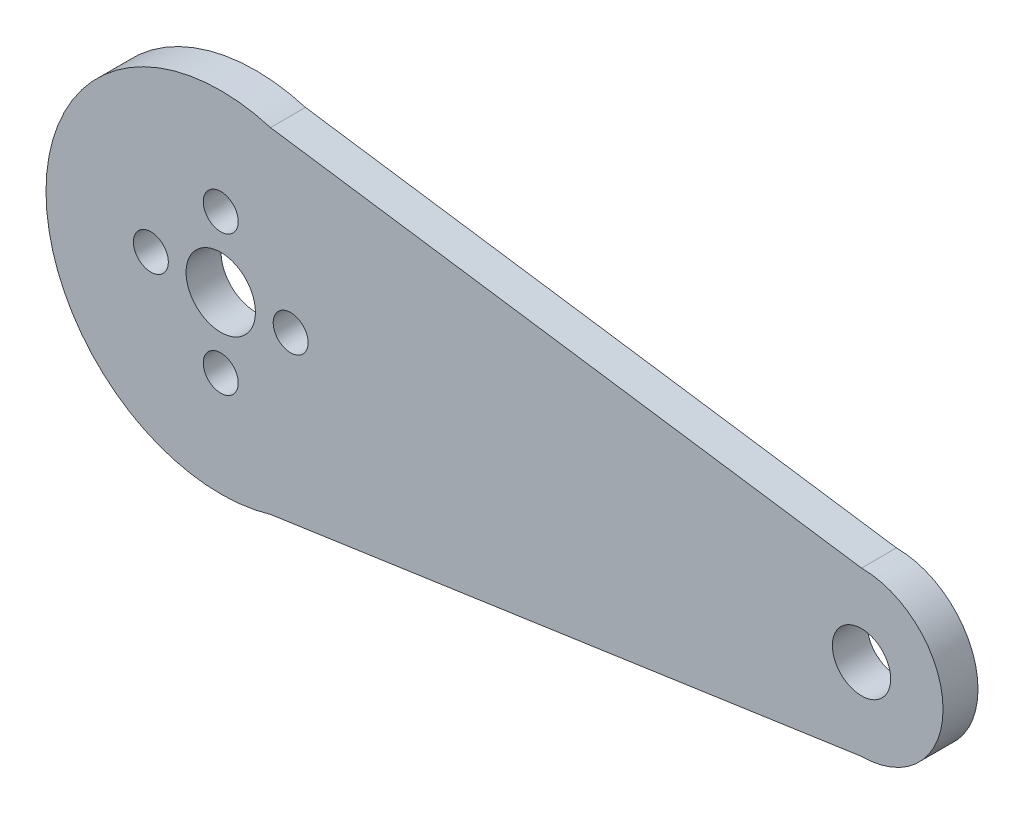
ISO-10303-21;
HEADER;
FILE_DESCRIPTION(('STEP AP214'),'2;1');
FILE_NAME('part.step','',(''),(''),'','','');
FILE_SCHEMA(('AUTOMOTIVE_DESIGN { 1 0 10303 214 1 1 1 1 }'));
ENDSEC;
DATA;
#1=APPLICATION_CONTEXT('core data for automotive mechanical design processes');
#2=APPLICATION_PROTOCOL_DEFINITION('international standard','automotive_design',2000,#1);
#3=PRODUCT_CONTEXT('',#1,'mechanical');
#4=PRODUCT('Part','Part','',(#3));
#5=PRODUCT_RELATED_PRODUCT_CATEGORY('part','',(#4));
#6=PRODUCT_DEFINITION_FORMATION('','',#4);
#7=PRODUCT_DEFINITION_CONTEXT('part definition',#1,'design');
#8=PRODUCT_DEFINITION('design','',#6,#7);
#9=PRODUCT_DEFINITION_SHAPE('','',#8);
#10=(LENGTH_UNIT() NAMED_UNIT(*) SI_UNIT(.MILLI.,.METRE.));
#11=(NAMED_UNIT(*) PLANE_ANGLE_UNIT() SI_UNIT($,.RADIAN.));
#12=(NAMED_UNIT(*) SI_UNIT($,.STERADIAN.) SOLID_ANGLE_UNIT());
#13=UNCERTAINTY_MEASURE_WITH_UNIT(LENGTH_MEASURE(1.E-05),#10,'distance_accuracy_value','');
#14=(GEOMETRIC_REPRESENTATION_CONTEXT(3) GLOBAL_UNCERTAINTY_ASSIGNED_CONTEXT((#13)) GLOBAL_UNIT_ASSIGNED_CONTEXT((#10,
#11,#12)) REPRESENTATION_CONTEXT('',''));
#15=CARTESIAN_POINT('',(0.,0.,0.));
#16=DIRECTION('',(0.,0.,1.));
#17=DIRECTION('',(1.,0.,0.));
#18=AXIS2_PLACEMENT_3D('',#15,#16,#17);
#19=CARTESIAN_POINT('',(-0.759875943961661,7.25048296530086,3.));
#20=DIRECTION('',(0.,0.,1.));
#21=DIRECTION('',(1.,0.,0.));
#22=AXIS2_PLACEMENT_3D('',#19,#20,#21);
#23=PLANE('',#22);
#24=DIRECTION('',(-0.989586439284512,0.143939845714111,0.));
#25=VECTOR('',#24,1.);
#26=CARTESIAN_POINT('',(-0.759875943961661,22.2504829653009,3.));
#27=LINE('',#26,#25);
#28=CARTESIAN_POINT('',(54.2401240560383,14.2504829653009,3.));
#29=VERTEX_POINT('',#28);
#30=CARTESIAN_POINT('',(3.51335163777999,21.6289225897748,3.));
#31=VERTEX_POINT('',#30);
#32=EDGE_CURVE('E92',#29,#31,#27,.T.);
#33=ORIENTED_EDGE('',*,*,#32,.T.);
#34=CARTESIAN_POINT('',(-0.759875943961661,7.25048296530086,3.));
#35=DIRECTION('',(0.,0.,1.));
#36=DIRECTION('',(1.,0.,0.));
#37=AXIS2_PLACEMENT_3D('',#34,#35,#36);
#38=CIRCLE('',#37,15.);
#39=CARTESIAN_POINT('',(3.51335163777999,-7.12795665917308,3.));
#40=VERTEX_POINT('',#39);
#41=EDGE_CURVE('E57',#31,#40,#38,.T.);
#42=ORIENTED_EDGE('',*,*,#41,.T.);
#43=DIRECTION('',(0.989586439284512,0.143939845714111,0.));
#44=VECTOR('',#43,1.);
#45=CARTESIAN_POINT('',(-0.759875943961661,-7.74951703469913,3.));
#46=LINE('',#45,#44);
#47=CARTESIAN_POINT('',(54.2401240560383,0.250482965300865,3.));
#48=VERTEX_POINT('',#47);
#49=EDGE_CURVE('E74',#40,#48,#46,.T.);
#50=ORIENTED_EDGE('',*,*,#49,.T.);
#51=CARTESIAN_POINT('',(54.2401240560383,7.25048296530086,3.));
#52=DIRECTION('',(0.,0.,1.));
#53=DIRECTION('',(1.,0.,0.));
#54=AXIS2_PLACEMENT_3D('',#51,#52,#53);
#55=CIRCLE('',#54,7.);
#56=EDGE_CURVE('E78',#48,#29,#55,.T.);
#57=ORIENTED_EDGE('',*,*,#56,.T.);
#58=EDGE_LOOP('',(#33,#42,#50,#57));
#59=FACE_BOUND('',#58,.T.);
#60=CARTESIAN_POINT('',(54.2401240560383,7.25048296530086,3.));
#61=DIRECTION('',(0.,0.,1.));
#62=DIRECTION('',(1.,0.,0.));
#63=AXIS2_PLACEMENT_3D('',#60,#61,#62);
#64=CIRCLE('',#63,2.5);
#65=CARTESIAN_POINT('',(56.7401240560383,7.25048296530086,3.));
#66=VERTEX_POINT('',#65);
#67=EDGE_CURVE('E81',#66,#66,#64,.T.);
#68=ORIENTED_EDGE('',*,*,#67,.F.);
#69=EDGE_LOOP('',(#68));
#70=FACE_BOUND('',#69,.T.);
#71=CARTESIAN_POINT('',(5.24012405603834,7.25048296530086,3.));
#72=DIRECTION('',(0.,0.,1.));
#73=DIRECTION('',(1.,0.,0.));
#74=AXIS2_PLACEMENT_3D('',#71,#72,#73);
#75=CIRCLE('',#74,1.5);
#76=CARTESIAN_POINT('',(6.74012405603834,7.25048296530086,3.));
#77=VERTEX_POINT('',#76);
#78=EDGE_CURVE('E106',#77,#77,#75,.T.);
#79=ORIENTED_EDGE('',*,*,#78,.F.);
#80=EDGE_LOOP('',(#79));
#81=FACE_BOUND('',#80,.T.);
#82=CARTESIAN_POINT('',(-6.75987594396166,7.25048296530086,3.));
#83=DIRECTION('',(0.,0.,1.));
#84=DIRECTION('',(1.,0.,0.));
#85=AXIS2_PLACEMENT_3D('',#82,#83,#84);
#86=CIRCLE('',#85,1.5);
#87=CARTESIAN_POINT('',(-5.25987594396166,7.25048296530086,3.));
#88=VERTEX_POINT('',#87);
#89=EDGE_CURVE('E118',#88,#88,#86,.T.);
#90=ORIENTED_EDGE('',*,*,#89,.F.);
#91=EDGE_LOOP('',(#90));
#92=FACE_BOUND('',#91,.T.);
#93=CARTESIAN_POINT('',(-0.759875943961661,7.25048296530086,3.));
#94=DIRECTION('',(0.,0.,1.));
#95=DIRECTION('',(1.,0.,0.));
#96=AXIS2_PLACEMENT_3D('',#93,#94,#95);
#97=CIRCLE('',#96,2.97685435318113);
#98=CARTESIAN_POINT('',(2.21697840921947,7.25048296530086,3.));
#99=VERTEX_POINT('',#98);
#100=EDGE_CURVE('E130',#99,#99,#97,.T.);
#101=ORIENTED_EDGE('',*,*,#100,.F.);
#102=EDGE_LOOP('',(#101));
#103=FACE_BOUND('',#102,.T.);
#104=CARTESIAN_POINT('',(-0.759875943961661,13.2504829653009,3.));
#105=DIRECTION('',(0.,0.,1.));
#106=DIRECTION('',(1.,0.,0.));
#107=AXIS2_PLACEMENT_3D('',#104,#105,#106);
#108=CIRCLE('',#107,1.5);
#109=CARTESIAN_POINT('',(0.740124056038339,13.2504829653009,3.));
#110=VERTEX_POINT('',#109);
#111=EDGE_CURVE('E124',#110,#110,#108,.T.);
#112=ORIENTED_EDGE('',*,*,#111,.F.);
#113=EDGE_LOOP('',(#112));
#114=FACE_BOUND('',#113,.T.);
#115=CARTESIAN_POINT('',(-0.759875943961661,1.25048296530086,3.));
#116=DIRECTION('',(0.,0.,1.));
#117=DIRECTION('',(1.,0.,0.));
#118=AXIS2_PLACEMENT_3D('',#115,#116,#117);
#119=CIRCLE('',#118,1.5);
#120=CARTESIAN_POINT('',(0.74012405603834,1.25048296530086,3.));
#121=VERTEX_POINT('',#120);
#122=EDGE_CURVE('E112',#121,#121,#119,.T.);
#123=ORIENTED_EDGE('',*,*,#122,.F.);
#124=EDGE_LOOP('',(#123));
#125=FACE_BOUND('',#124,.T.);
#126=ADVANCED_FACE('F35',(#59,#70,#81,#92,#103,#114,#125),#23,.T.);
#127=CARTESIAN_POINT('',(-0.759875943961661,7.25048296530086,0.));
#128=DIRECTION('',(0.,0.,1.));
#129=DIRECTION('',(1.,0.,0.));
#130=AXIS2_PLACEMENT_3D('',#127,#128,#129);
#131=PLANE('',#130);
#132=DIRECTION('',(-0.989586439284512,-0.143939845714111,0.));
#133=VECTOR('',#132,1.);
#134=CARTESIAN_POINT('',(-0.759875943961661,-7.74951703469913,0.));
#135=LINE('',#134,#133);
#136=CARTESIAN_POINT('',(54.2401240560383,0.250482965300865,0.));
#137=VERTEX_POINT('',#136);
#138=CARTESIAN_POINT('',(3.51335163777999,-7.12795665917308,0.));
#139=VERTEX_POINT('',#138);
#140=EDGE_CURVE('E88',#137,#139,#135,.T.);
#141=ORIENTED_EDGE('',*,*,#140,.T.);
#142=CARTESIAN_POINT('',(-0.759875943961661,7.25048296530086,0.));
#143=DIRECTION('',(0.,0.,1.));
#144=DIRECTION('',(1.,0.,0.));
#145=AXIS2_PLACEMENT_3D('',#142,#143,#144);
#146=CIRCLE('',#145,15.);
#147=CARTESIAN_POINT('',(3.51335163777999,21.6289225897748,0.));
#148=VERTEX_POINT('',#147);
#149=EDGE_CURVE('E49',#148,#139,#146,.T.);
#150=ORIENTED_EDGE('',*,*,#149,.F.);
#151=DIRECTION('',(0.989586439284512,-0.143939845714111,0.));
#152=VECTOR('',#151,1.);
#153=CARTESIAN_POINT('',(-0.759875943961661,22.2504829653009,0.));
#154=LINE('',#153,#152);
#155=CARTESIAN_POINT('',(54.2401240560383,14.2504829653009,0.));
#156=VERTEX_POINT('',#155);
#157=EDGE_CURVE('E139',#148,#156,#154,.T.);
#158=ORIENTED_EDGE('',*,*,#157,.T.);
#159=CARTESIAN_POINT('',(54.2401240560383,7.25048296530086,0.));
#160=DIRECTION('',(0.,0.,1.));
#161=DIRECTION('',(1.,0.,0.));
#162=AXIS2_PLACEMENT_3D('',#159,#160,#161);
#163=CIRCLE('',#162,7.);
#164=EDGE_CURVE('E100',#156,#137,#163,.F.);
#165=ORIENTED_EDGE('',*,*,#164,.T.);
#166=EDGE_LOOP('',(#141,#150,#158,#165));
#167=FACE_BOUND('',#166,.T.);
#168=CARTESIAN_POINT('',(54.2401240560383,7.25048296530086,0.));
#169=DIRECTION('',(0.,0.,1.));
#170=DIRECTION('',(1.,0.,0.));
#171=AXIS2_PLACEMENT_3D('',#168,#169,#170);
#172=CIRCLE('',#171,2.5);
#173=CARTESIAN_POINT('',(56.7401240560383,7.25048296530086,0.));
#174=VERTEX_POINT('',#173);
#175=EDGE_CURVE('E102',#174,#174,#172,.F.);
#176=ORIENTED_EDGE('',*,*,#175,.F.);
#177=EDGE_LOOP('',(#176));
#178=FACE_BOUND('',#177,.T.);
#179=CARTESIAN_POINT('',(-0.759875943961661,7.25048296530086,0.));
#180=DIRECTION('',(0.,0.,1.));
#181=DIRECTION('',(1.,0.,0.));
#182=AXIS2_PLACEMENT_3D('',#179,#180,#181);
#183=CIRCLE('',#182,2.97685435318113);
#184=CARTESIAN_POINT('',(2.21697840921947,7.25048296530086,0.));
#185=VERTEX_POINT('',#184);
#186=EDGE_CURVE('E127',#185,#185,#183,.T.);
#187=ORIENTED_EDGE('',*,*,#186,.T.);
#188=EDGE_LOOP('',(#187));
#189=FACE_BOUND('',#188,.T.);
#190=CARTESIAN_POINT('',(-0.759875943961661,13.2504829653009,0.));
#191=DIRECTION('',(0.,0.,1.));
#192=DIRECTION('',(1.,0.,0.));
#193=AXIS2_PLACEMENT_3D('',#190,#191,#192);
#194=CIRCLE('',#193,1.5);
#195=CARTESIAN_POINT('',(0.740124056038339,13.2504829653009,0.));
#196=VERTEX_POINT('',#195);
#197=EDGE_CURVE('E121',#196,#196,#194,.T.);
#198=ORIENTED_EDGE('',*,*,#197,.T.);
#199=EDGE_LOOP('',(#198));
#200=FACE_BOUND('',#199,.T.);
#201=CARTESIAN_POINT('',(-6.75987594396166,7.25048296530086,0.));
#202=DIRECTION('',(0.,0.,1.));
#203=DIRECTION('',(1.,0.,0.));
#204=AXIS2_PLACEMENT_3D('',#201,#202,#203);
#205=CIRCLE('',#204,1.5);
#206=CARTESIAN_POINT('',(-5.25987594396166,7.25048296530086,0.));
#207=VERTEX_POINT('',#206);
#208=EDGE_CURVE('E115',#207,#207,#205,.T.);
#209=ORIENTED_EDGE('',*,*,#208,.T.);
#210=EDGE_LOOP('',(#209));
#211=FACE_BOUND('',#210,.T.);
#212=CARTESIAN_POINT('',(-0.759875943961661,1.25048296530086,0.));
#213=DIRECTION('',(0.,0.,1.));
#214=DIRECTION('',(1.,0.,0.));
#215=AXIS2_PLACEMENT_3D('',#212,#213,#214);
#216=CIRCLE('',#215,1.5);
#217=CARTESIAN_POINT('',(0.74012405603834,1.25048296530086,0.));
#218=VERTEX_POINT('',#217);
#219=EDGE_CURVE('E109',#218,#218,#216,.T.);
#220=ORIENTED_EDGE('',*,*,#219,.T.);
#221=EDGE_LOOP('',(#220));
#222=FACE_BOUND('',#221,.T.);
#223=CARTESIAN_POINT('',(5.24012405603834,7.25048296530086,0.));
#224=DIRECTION('',(0.,0.,1.));
#225=DIRECTION('',(1.,0.,0.));
#226=AXIS2_PLACEMENT_3D('',#223,#224,#225);
#227=CIRCLE('',#226,1.5);
#228=CARTESIAN_POINT('',(6.74012405603834,7.25048296530086,0.));
#229=VERTEX_POINT('',#228);
#230=EDGE_CURVE('E105',#229,#229,#227,.T.);
#231=ORIENTED_EDGE('',*,*,#230,.T.);
#232=EDGE_LOOP('',(#231));
#233=FACE_BOUND('',#232,.T.);
#234=ADVANCED_FACE('F151',(#167,#178,#189,#200,#211,#222,#233),#131,.F.);
#235=CARTESIAN_POINT('',(-0.759875943961661,7.25048296530086,3.));
#236=DIRECTION('',(0.,0.,-1.));
#237=DIRECTION('',(-1.,0.,0.));
#238=AXIS2_PLACEMENT_3D('',#235,#236,#237);
#239=CYLINDRICAL_SURFACE('',#238,15.);
#240=DIRECTION('',(0.,0.,-1.));
#241=VECTOR('',#240,1.);
#242=CARTESIAN_POINT('',(3.51335163777998,-7.12795665917308,3.));
#243=LINE('',#242,#241);
#244=EDGE_CURVE('E11',#139,#40,#243,.F.);
#245=ORIENTED_EDGE('',*,*,#244,.T.);
#246=ORIENTED_EDGE('',*,*,#41,.F.);
#247=DIRECTION('',(0.,0.,-1.));
#248=VECTOR('',#247,1.);
#249=CARTESIAN_POINT('',(3.51335163777998,21.6289225897748,3.));
#250=LINE('',#249,#248);
#251=EDGE_CURVE('E43',#31,#148,#250,.T.);
#252=ORIENTED_EDGE('',*,*,#251,.T.);
#253=ORIENTED_EDGE('',*,*,#149,.T.);
#254=EDGE_LOOP('',(#245,#246,#252,#253));
#255=FACE_BOUND('',#254,.T.);
#256=ADVANCED_FACE('F37',(#255),#239,.T.);
#257=CARTESIAN_POINT('',(-0.759875943961661,7.25048296530086,3.));
#258=DIRECTION('',(0.,0.,-1.));
#259=DIRECTION('',(-1.,0.,0.));
#260=AXIS2_PLACEMENT_3D('',#257,#258,#259);
#261=CYLINDRICAL_SURFACE('',#260,2.97685435318113);
#262=ORIENTED_EDGE('',*,*,#100,.T.);
#263=EDGE_LOOP('',(#262));
#264=FACE_BOUND('',#263,.T.);
#265=ORIENTED_EDGE('',*,*,#186,.F.);
#266=EDGE_LOOP('',(#265));
#267=FACE_BOUND('',#266,.T.);
#268=ADVANCED_FACE('F190',(#264,#267),#261,.F.);
#269=CARTESIAN_POINT('',(-0.759875943961661,13.2504829653009,3.));
#270=DIRECTION('',(0.,0.,-1.));
#271=DIRECTION('',(-1.,0.,0.));
#272=AXIS2_PLACEMENT_3D('',#269,#270,#271);
#273=CYLINDRICAL_SURFACE('',#272,1.5);
#274=ORIENTED_EDGE('',*,*,#111,.T.);
#275=EDGE_LOOP('',(#274));
#276=FACE_BOUND('',#275,.T.);
#277=ORIENTED_EDGE('',*,*,#197,.F.);
#278=EDGE_LOOP('',(#277));
#279=FACE_BOUND('',#278,.T.);
#280=ADVANCED_FACE('F186',(#276,#279),#273,.F.);
#281=CARTESIAN_POINT('',(-6.75987594396166,7.25048296530086,3.));
#282=DIRECTION('',(0.,0.,-1.));
#283=DIRECTION('',(-1.,0.,0.));
#284=AXIS2_PLACEMENT_3D('',#281,#282,#283);
#285=CYLINDRICAL_SURFACE('',#284,1.5);
#286=ORIENTED_EDGE('',*,*,#89,.T.);
#287=EDGE_LOOP('',(#286));
#288=FACE_BOUND('',#287,.T.);
#289=ORIENTED_EDGE('',*,*,#208,.F.);
#290=EDGE_LOOP('',(#289));
#291=FACE_BOUND('',#290,.T.);
#292=ADVANCED_FACE('F167',(#288,#291),#285,.F.);
#293=CARTESIAN_POINT('',(-0.759875943961661,1.25048296530086,3.));
#294=DIRECTION('',(0.,0.,-1.));
#295=DIRECTION('',(-1.,0.,0.));
#296=AXIS2_PLACEMENT_3D('',#293,#294,#295);
#297=CYLINDRICAL_SURFACE('',#296,1.5);
#298=ORIENTED_EDGE('',*,*,#122,.T.);
#299=EDGE_LOOP('',(#298));
#300=FACE_BOUND('',#299,.T.);
#301=ORIENTED_EDGE('',*,*,#219,.F.);
#302=EDGE_LOOP('',(#301));
#303=FACE_BOUND('',#302,.T.);
#304=ADVANCED_FACE('F163',(#300,#303),#297,.F.);
#305=CARTESIAN_POINT('',(5.24012405603834,7.25048296530086,3.));
#306=DIRECTION('',(0.,0.,-1.));
#307=DIRECTION('',(-1.,0.,0.));
#308=AXIS2_PLACEMENT_3D('',#305,#306,#307);
#309=CYLINDRICAL_SURFACE('',#308,1.5);
#310=ORIENTED_EDGE('',*,*,#78,.T.);
#311=EDGE_LOOP('',(#310));
#312=FACE_BOUND('',#311,.T.);
#313=ORIENTED_EDGE('',*,*,#230,.F.);
#314=EDGE_LOOP('',(#313));
#315=FACE_BOUND('',#314,.T.);
#316=ADVANCED_FACE('F166',(#312,#315),#309,.F.);
#317=CARTESIAN_POINT('',(-0.759875943961661,-7.74951703469913,-68.8767014308903));
#318=DIRECTION('',(0.143939845714111,-0.989586439284512,0.));
#319=DIRECTION('',(0.989586439284512,0.143939845714111,0.));
#320=AXIS2_PLACEMENT_3D('',#317,#318,#319);
#321=PLANE('',#320);
#322=ORIENTED_EDGE('',*,*,#244,.F.);
#323=ORIENTED_EDGE('',*,*,#140,.F.);
#324=DIRECTION('',(0.,0.,1.));
#325=VECTOR('',#324,1.);
#326=CARTESIAN_POINT('',(54.2401240560383,0.250482965300865,-68.8767014308903));
#327=LINE('',#326,#325);
#328=EDGE_CURVE('E85',#137,#48,#327,.T.);
#329=ORIENTED_EDGE('',*,*,#328,.T.);
#330=ORIENTED_EDGE('',*,*,#49,.F.);
#331=EDGE_LOOP('',(#322,#323,#329,#330));
#332=FACE_BOUND('',#331,.T.);
#333=ADVANCED_FACE('F86',(#332),#321,.T.);
#334=CARTESIAN_POINT('',(-0.759875943961661,22.2504829653009,-68.8767014308903));
#335=DIRECTION('',(0.143939845714111,0.989586439284512,0.));
#336=DIRECTION('',(-0.989586439284512,0.143939845714111,0.));
#337=AXIS2_PLACEMENT_3D('',#334,#335,#336);
#338=PLANE('',#337);
#339=ORIENTED_EDGE('',*,*,#251,.F.);
#340=ORIENTED_EDGE('',*,*,#32,.F.);
#341=DIRECTION('',(0.,0.,1.));
#342=VECTOR('',#341,1.);
#343=CARTESIAN_POINT('',(54.2401240560383,14.2504829653009,-68.8767014308903));
#344=LINE('',#343,#342);
#345=EDGE_CURVE('E91',#156,#29,#344,.T.);
#346=ORIENTED_EDGE('',*,*,#345,.F.);
#347=ORIENTED_EDGE('',*,*,#157,.F.);
#348=EDGE_LOOP('',(#339,#340,#346,#347));
#349=FACE_BOUND('',#348,.T.);
#350=ADVANCED_FACE('F140',(#349),#338,.T.);
#351=CARTESIAN_POINT('',(54.2401240560383,7.25048296530086,-68.8767014308903));
#352=DIRECTION('',(0.,0.,1.));
#353=DIRECTION('',(1.,0.,0.));
#354=AXIS2_PLACEMENT_3D('',#351,#352,#353);
#355=CYLINDRICAL_SURFACE('',#354,7.);
#356=ORIENTED_EDGE('',*,*,#164,.F.);
#357=ORIENTED_EDGE('',*,*,#345,.T.);
#358=ORIENTED_EDGE('',*,*,#56,.F.);
#359=ORIENTED_EDGE('',*,*,#328,.F.);
#360=EDGE_LOOP('',(#356,#357,#358,#359));
#361=FACE_BOUND('',#360,.T.);
#362=ADVANCED_FACE('F94',(#361),#355,.T.);
#363=CARTESIAN_POINT('',(54.2401240560383,7.25048296530086,-68.8767014308903));
#364=DIRECTION('',(0.,0.,1.));
#365=DIRECTION('',(1.,0.,0.));
#366=AXIS2_PLACEMENT_3D('',#363,#364,#365);
#367=CYLINDRICAL_SURFACE('',#366,2.5);
#368=ORIENTED_EDGE('',*,*,#175,.T.);
#369=EDGE_LOOP('',(#368));
#370=FACE_BOUND('',#369,.T.);
#371=ORIENTED_EDGE('',*,*,#67,.T.);
#372=EDGE_LOOP('',(#371));
#373=FACE_BOUND('',#372,.T.);
#374=ADVANCED_FACE('F148',(#370,#373),#367,.F.);
#375=CLOSED_SHELL('',(#126,#234,#256,#268,#280,#292,#304,#316,#333,#350,#362,#374));
#376=MANIFOLD_SOLID_BREP('B2',#375);
#377=ADVANCED_BREP_SHAPE_REPRESENTATION('',(#18,#376),#14);
#378=SHAPE_DEFINITION_REPRESENTATION(#9,#377);
ENDSEC;
END-ISO-10303-21;
